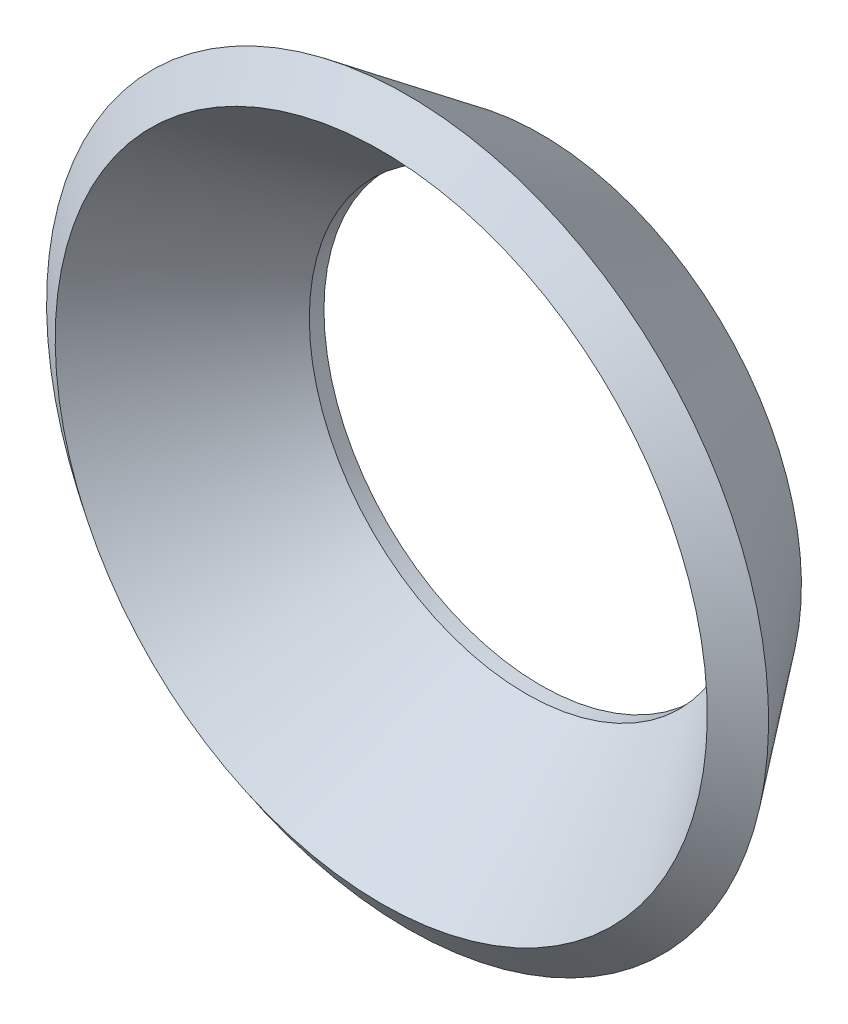
ISO-10303-21;
HEADER;
FILE_DESCRIPTION(('STEP AP214'),'2;1');
FILE_NAME('part.step','',(''),(''),'','','');
FILE_SCHEMA(('AUTOMOTIVE_DESIGN { 1 0 10303 214 1 1 1 1 }'));
ENDSEC;
DATA;
#1=APPLICATION_CONTEXT('core data for automotive mechanical design processes');
#2=APPLICATION_PROTOCOL_DEFINITION('international standard','automotive_design',2000,#1);
#3=PRODUCT_CONTEXT('',#1,'mechanical');
#4=PRODUCT('Part','Part','',(#3));
#5=PRODUCT_RELATED_PRODUCT_CATEGORY('part','',(#4));
#6=PRODUCT_DEFINITION_FORMATION('','',#4);
#7=PRODUCT_DEFINITION_CONTEXT('part definition',#1,'design');
#8=PRODUCT_DEFINITION('design','',#6,#7);
#9=PRODUCT_DEFINITION_SHAPE('','',#8);
#10=(LENGTH_UNIT() NAMED_UNIT(*) SI_UNIT(.MILLI.,.METRE.));
#11=(NAMED_UNIT(*) PLANE_ANGLE_UNIT() SI_UNIT($,.RADIAN.));
#12=(NAMED_UNIT(*) SI_UNIT($,.STERADIAN.) SOLID_ANGLE_UNIT());
#13=UNCERTAINTY_MEASURE_WITH_UNIT(LENGTH_MEASURE(1.E-05),#10,'distance_accuracy_value','');
#14=(GEOMETRIC_REPRESENTATION_CONTEXT(3) GLOBAL_UNCERTAINTY_ASSIGNED_CONTEXT((#13)) GLOBAL_UNIT_ASSIGNED_CONTEXT((#10,
#11,#12)) REPRESENTATION_CONTEXT('',''));
#15=CARTESIAN_POINT('',(0.,0.,0.));
#16=DIRECTION('',(0.,0.,1.));
#17=DIRECTION('',(1.,0.,0.));
#18=AXIS2_PLACEMENT_3D('',#15,#16,#17);
#19=CARTESIAN_POINT('',(0.,5.2832000000001,0.));
#20=DIRECTION('',(0.,0.,1.));
#21=DIRECTION('',(0.,-1.,0.));
#22=AXIS2_PLACEMENT_3D('',#19,#20,#21);
#23=PLANE('',#22);
#24=CARTESIAN_POINT('',(0.,0.,0.));
#25=DIRECTION('',(0.,0.,1.));
#26=DIRECTION('',(0.,-1.,0.));
#27=AXIS2_PLACEMENT_3D('',#24,#25,#26);
#28=CIRCLE('',#27,6.35);
#29=CARTESIAN_POINT('',(0.,-6.35000000000001,0.));
#30=VERTEX_POINT('',#29);
#31=EDGE_CURVE('E57',#30,#30,#28,.T.);
#32=ORIENTED_EDGE('',*,*,#31,.F.);
#33=EDGE_LOOP('',(#32));
#34=FACE_BOUND('',#33,.T.);
#35=CARTESIAN_POINT('',(0.,0.,0.));
#36=DIRECTION('',(0.,0.,1.));
#37=DIRECTION('',(0.,-1.,0.));
#38=AXIS2_PLACEMENT_3D('',#35,#36,#37);
#39=CIRCLE('',#38,5.2832);
#40=CARTESIAN_POINT('',(0.,-5.28320000000001,0.));
#41=VERTEX_POINT('',#40);
#42=EDGE_CURVE('E12',#41,#41,#39,.T.);
#43=ORIENTED_EDGE('',*,*,#42,.T.);
#44=EDGE_LOOP('',(#43));
#45=FACE_BOUND('',#44,.T.);
#46=ADVANCED_FACE('F38',(#34,#45),#23,.F.);
#47=CARTESIAN_POINT('',(0.,0.,0.));
#48=DIRECTION('',(0.,0.,1.));
#49=DIRECTION('',(0.,-1.,0.));
#50=AXIS2_PLACEMENT_3D('',#47,#48,#49);
#51=CYLINDRICAL_SURFACE('',#50,5.2832);
#52=ORIENTED_EDGE('',*,*,#42,.F.);
#53=EDGE_LOOP('',(#52));
#54=FACE_BOUND('',#53,.T.);
#55=CARTESIAN_POINT('',(0.,0.,0.356946286844795));
#56=DIRECTION('',(0.,0.,1.));
#57=DIRECTION('',(0.,-1.,0.));
#58=AXIS2_PLACEMENT_3D('',#55,#56,#57);
#59=CIRCLE('',#58,5.2832);
#60=CARTESIAN_POINT('',(0.,-5.28320000000006,0.356946286844794));
#61=VERTEX_POINT('',#60);
#62=EDGE_CURVE('E44',#61,#61,#59,.T.);
#63=ORIENTED_EDGE('',*,*,#62,.T.);
#64=EDGE_LOOP('',(#63));
#65=FACE_BOUND('',#64,.T.);
#66=ADVANCED_FACE('F64',(#54,#65),#51,.F.);
#67=CARTESIAN_POINT('',(0.,0.,3.8876709795308));
#68=DIRECTION('',(0.,0.,1.));
#69=DIRECTION('',(0.,-1.,0.));
#70=AXIS2_PLACEMENT_3D('',#67,#68,#69);
#71=CONICAL_SURFACE('',#70,7.94379189197148,0.645771823237903);
#72=ORIENTED_EDGE('',*,*,#62,.F.);
#73=EDGE_LOOP('',(#72));
#74=FACE_BOUND('',#73,.T.);
#75=CARTESIAN_POINT('',(0.,0.,3.8876709795308));
#76=DIRECTION('',(0.,0.,1.));
#77=DIRECTION('',(0.,-1.,0.));
#78=AXIS2_PLACEMENT_3D('',#75,#76,#77);
#79=CIRCLE('',#78,7.94379189197148);
#80=CARTESIAN_POINT('',(0.,-7.94379189197154,3.8876709795308));
#81=VERTEX_POINT('',#80);
#82=EDGE_CURVE('E48',#81,#81,#79,.T.);
#83=ORIENTED_EDGE('',*,*,#82,.T.);
#84=EDGE_LOOP('',(#83));
#85=FACE_BOUND('',#84,.T.);
#86=ADVANCED_FACE('F68',(#74,#85),#71,.F.);
#87=CARTESIAN_POINT('',(0.,0.,3.24565471283222));
#88=DIRECTION('',(0.,0.,-1.));
#89=DIRECTION('',(0.,1.,0.));
#90=AXIS2_PLACEMENT_3D('',#87,#88,#89);
#91=CONICAL_SURFACE('',#90,8.79577625408993,0.925024503556994);
#92=ORIENTED_EDGE('',*,*,#82,.F.);
#93=EDGE_LOOP('',(#92));
#94=FACE_BOUND('',#93,.T.);
#95=CARTESIAN_POINT('',(0.,0.,3.24565471283222));
#96=DIRECTION('',(0.,0.,1.));
#97=DIRECTION('',(0.,-1.,0.));
#98=AXIS2_PLACEMENT_3D('',#95,#96,#97);
#99=CIRCLE('',#98,8.79577625408993);
#100=CARTESIAN_POINT('',(0.,-8.79577625409,3.24565471283222));
#101=VERTEX_POINT('',#100);
#102=EDGE_CURVE('E52',#101,#101,#99,.T.);
#103=ORIENTED_EDGE('',*,*,#102,.T.);
#104=EDGE_LOOP('',(#103));
#105=FACE_BOUND('',#104,.T.);
#106=ADVANCED_FACE('F73',(#94,#105),#91,.T.);
#107=CARTESIAN_POINT('',(0.,0.,0.));
#108=DIRECTION('',(0.,0.,1.));
#109=DIRECTION('',(0.,-1.,0.));
#110=AXIS2_PLACEMENT_3D('',#107,#108,#109);
#111=CONICAL_SURFACE('',#110,6.35,0.645771823237903);
#112=ORIENTED_EDGE('',*,*,#102,.F.);
#113=EDGE_LOOP('',(#112));
#114=FACE_BOUND('',#113,.T.);
#115=ORIENTED_EDGE('',*,*,#31,.T.);
#116=EDGE_LOOP('',(#115));
#117=FACE_BOUND('',#116,.T.);
#118=ADVANCED_FACE('F61',(#114,#117),#111,.T.);
#119=CLOSED_SHELL('',(#46,#66,#86,#106,#118));
#120=MANIFOLD_SOLID_BREP('B2',#119);
#121=ADVANCED_BREP_SHAPE_REPRESENTATION('',(#18,#120),#14);
#122=SHAPE_DEFINITION_REPRESENTATION(#9,#121);
ENDSEC;
END-ISO-10303-21;
